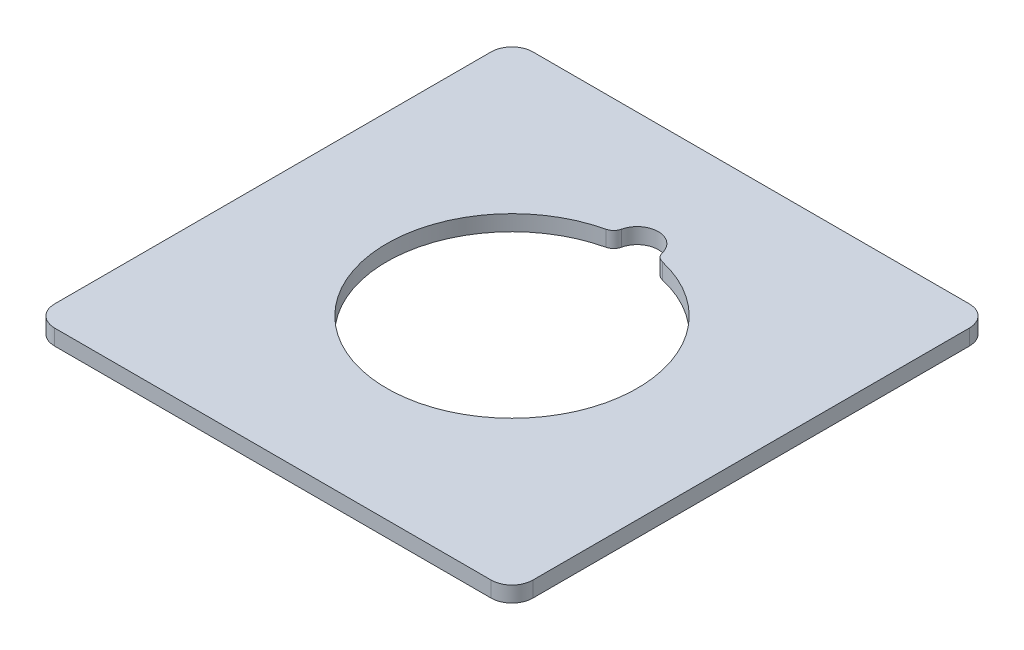
ISO-10303-21;
HEADER;
FILE_DESCRIPTION(('STEP AP214'),'2;1');
FILE_NAME('part.step','',(''),(''),'','','');
FILE_SCHEMA(('AUTOMOTIVE_DESIGN { 1 0 10303 214 1 1 1 1 }'));
ENDSEC;
DATA;
#1=APPLICATION_CONTEXT('core data for automotive mechanical design processes');
#2=APPLICATION_PROTOCOL_DEFINITION('international standard','automotive_design',2000,#1);
#3=PRODUCT_CONTEXT('',#1,'mechanical');
#4=PRODUCT('Part','Part','',(#3));
#5=PRODUCT_RELATED_PRODUCT_CATEGORY('part','',(#4));
#6=PRODUCT_DEFINITION_FORMATION('','',#4);
#7=PRODUCT_DEFINITION_CONTEXT('part definition',#1,'design');
#8=PRODUCT_DEFINITION('design','',#6,#7);
#9=PRODUCT_DEFINITION_SHAPE('','',#8);
#10=(LENGTH_UNIT() NAMED_UNIT(*) SI_UNIT(.MILLI.,.METRE.));
#11=(NAMED_UNIT(*) PLANE_ANGLE_UNIT() SI_UNIT($,.RADIAN.));
#12=(NAMED_UNIT(*) SI_UNIT($,.STERADIAN.) SOLID_ANGLE_UNIT());
#13=UNCERTAINTY_MEASURE_WITH_UNIT(LENGTH_MEASURE(1.E-05),#10,'distance_accuracy_value','');
#14=(GEOMETRIC_REPRESENTATION_CONTEXT(3) GLOBAL_UNCERTAINTY_ASSIGNED_CONTEXT((#13)) GLOBAL_UNIT_ASSIGNED_CONTEXT((#10,
#11,#12)) REPRESENTATION_CONTEXT('',''));
#15=CARTESIAN_POINT('',(0.,0.,0.));
#16=DIRECTION('',(0.,0.,1.));
#17=DIRECTION('',(1.,0.,0.));
#18=AXIS2_PLACEMENT_3D('',#15,#16,#17);
#19=CARTESIAN_POINT('',(20.9,1.5,20.9));
#20=DIRECTION('',(0.,1.,0.));
#21=DIRECTION('',(0.,0.,1.));
#22=AXIS2_PLACEMENT_3D('',#19,#20,#21);
#23=PLANE('',#22);
#24=CARTESIAN_POINT('',(20.9,1.5,20.9));
#25=DIRECTION('',(0.,1.,0.));
#26=DIRECTION('',(0.,0.,1.));
#27=AXIS2_PLACEMENT_3D('',#24,#25,#26);
#28=CIRCLE('',#27,2.);
#29=CARTESIAN_POINT('',(20.9,1.5,22.9));
#30=VERTEX_POINT('',#29);
#31=CARTESIAN_POINT('',(22.9,1.5,20.9));
#32=VERTEX_POINT('',#31);
#33=EDGE_CURVE('E157',#30,#32,#28,.T.);
#34=ORIENTED_EDGE('',*,*,#33,.T.);
#35=DIRECTION('',(0.,0.,-1.));
#36=VECTOR('',#35,1.);
#37=CARTESIAN_POINT('',(22.9,1.5,20.9));
#38=LINE('',#37,#36);
#39=CARTESIAN_POINT('',(22.9,1.5,-20.9));
#40=VERTEX_POINT('',#39);
#41=EDGE_CURVE('E160',#32,#40,#38,.T.);
#42=ORIENTED_EDGE('',*,*,#41,.T.);
#43=CARTESIAN_POINT('',(20.9,1.5,-20.9));
#44=DIRECTION('',(0.,1.,0.));
#45=DIRECTION('',(0.,0.,-1.));
#46=AXIS2_PLACEMENT_3D('',#43,#44,#45);
#47=CIRCLE('',#46,2.);
#48=CARTESIAN_POINT('',(20.9,1.5,-22.9));
#49=VERTEX_POINT('',#48);
#50=EDGE_CURVE('E163',#40,#49,#47,.T.);
#51=ORIENTED_EDGE('',*,*,#50,.T.);
#52=DIRECTION('',(-1.,0.,0.));
#53=VECTOR('',#52,1.);
#54=CARTESIAN_POINT('',(-20.9,1.5,-22.9));
#55=LINE('',#54,#53);
#56=CARTESIAN_POINT('',(-20.9,1.5,-22.9));
#57=VERTEX_POINT('',#56);
#58=EDGE_CURVE('E165',#49,#57,#55,.T.);
#59=ORIENTED_EDGE('',*,*,#58,.T.);
#60=CARTESIAN_POINT('',(-20.9,1.5,-20.9));
#61=DIRECTION('',(0.,1.,0.));
#62=DIRECTION('',(0.,0.,-1.));
#63=AXIS2_PLACEMENT_3D('',#60,#61,#62);
#64=CIRCLE('',#63,2.);
#65=CARTESIAN_POINT('',(-22.9,1.5,-20.9));
#66=VERTEX_POINT('',#65);
#67=EDGE_CURVE('E167',#57,#66,#64,.T.);
#68=ORIENTED_EDGE('',*,*,#67,.T.);
#69=DIRECTION('',(0.,0.,1.));
#70=VECTOR('',#69,1.);
#71=CARTESIAN_POINT('',(-22.9,1.5,20.9));
#72=LINE('',#71,#70);
#73=CARTESIAN_POINT('',(-22.9,1.5,20.9));
#74=VERTEX_POINT('',#73);
#75=EDGE_CURVE('E169',#66,#74,#72,.T.);
#76=ORIENTED_EDGE('',*,*,#75,.T.);
#77=CARTESIAN_POINT('',(-20.9,1.5,20.9));
#78=DIRECTION('',(0.,1.,0.));
#79=DIRECTION('',(0.,0.,-1.));
#80=AXIS2_PLACEMENT_3D('',#77,#78,#79);
#81=CIRCLE('',#80,2.);
#82=CARTESIAN_POINT('',(-20.9,1.5,22.9));
#83=VERTEX_POINT('',#82);
#84=EDGE_CURVE('E171',#74,#83,#81,.T.);
#85=ORIENTED_EDGE('',*,*,#84,.T.);
#86=DIRECTION('',(1.,0.,0.));
#87=VECTOR('',#86,1.);
#88=CARTESIAN_POINT('',(-20.9,1.5,22.9));
#89=LINE('',#88,#87);
#90=EDGE_CURVE('E173',#83,#30,#89,.T.);
#91=ORIENTED_EDGE('',*,*,#90,.T.);
#92=EDGE_LOOP('',(#34,#42,#51,#59,#68,#76,#85,#91));
#93=FACE_BOUND('',#92,.T.);
#94=CARTESIAN_POINT('',(0.,1.5,-11.9935026557354));
#95=DIRECTION('',(0.,1.,0.));
#96=DIRECTION('',(0.,0.,-1.));
#97=AXIS2_PLACEMENT_3D('',#94,#95,#96);
#98=CIRCLE('',#97,2.00649734426464);
#99=CARTESIAN_POINT('',(1.95574883411882,1.5,-12.4419199729566));
#100=VERTEX_POINT('',#99);
#101=CARTESIAN_POINT('',(-1.95574883411884,1.5,-12.4419199729566));
#102=VERTEX_POINT('',#101);
#103=EDGE_CURVE('E129',#100,#102,#98,.T.);
#104=ORIENTED_EDGE('',*,*,#103,.F.);
#105=CARTESIAN_POINT('',(2.93045674475181,1.5,-12.665402609753));
#106=DIRECTION('',(0.,-1.,0.));
#107=DIRECTION('',(0.,0.,1.));
#108=AXIS2_PLACEMENT_3D('',#105,#106,#107);
#109=CIRCLE('',#108,1.);
#110=CARTESIAN_POINT('',(2.70503699515552,1.5,-11.6911408705412));
#111=VERTEX_POINT('',#110);
#112=EDGE_CURVE('E121',#111,#100,#109,.T.);
#113=ORIENTED_EDGE('',*,*,#112,.F.);
#114=CARTESIAN_POINT('',(0.,1.5,0.));
#115=DIRECTION('',(0.,1.,0.));
#116=DIRECTION('',(0.,0.,1.));
#117=AXIS2_PLACEMENT_3D('',#114,#115,#116);
#118=CIRCLE('',#117,12.);
#119=CARTESIAN_POINT('',(-2.70503699515553,1.5,-11.6911408705412));
#120=VERTEX_POINT('',#119);
#121=EDGE_CURVE('E143',#120,#111,#118,.T.);
#122=ORIENTED_EDGE('',*,*,#121,.F.);
#123=CARTESIAN_POINT('',(-2.93045674475182,1.5,-12.665402609753));
#124=DIRECTION('',(0.,-1.,0.));
#125=DIRECTION('',(0.,0.,-1.));
#126=AXIS2_PLACEMENT_3D('',#123,#124,#125);
#127=CIRCLE('',#126,1.);
#128=EDGE_CURVE('E141',#102,#120,#127,.T.);
#129=ORIENTED_EDGE('',*,*,#128,.F.);
#130=EDGE_LOOP('',(#104,#113,#122,#129));
#131=FACE_BOUND('',#130,.T.);
#132=ADVANCED_FACE('F32',(#93,#131),#23,.T.);
#133=CARTESIAN_POINT('',(20.9,0.,20.9));
#134=DIRECTION('',(0.,1.,0.));
#135=DIRECTION('',(0.,0.,1.));
#136=AXIS2_PLACEMENT_3D('',#133,#134,#135);
#137=PLANE('',#136);
#138=CARTESIAN_POINT('',(20.9,0.,20.9));
#139=DIRECTION('',(0.,1.,0.));
#140=DIRECTION('',(0.,0.,1.));
#141=AXIS2_PLACEMENT_3D('',#138,#139,#140);
#142=CIRCLE('',#141,2.);
#143=CARTESIAN_POINT('',(20.9,0.,22.9));
#144=VERTEX_POINT('',#143);
#145=CARTESIAN_POINT('',(22.9,0.,20.9));
#146=VERTEX_POINT('',#145);
#147=EDGE_CURVE('E137',#144,#146,#142,.T.);
#148=ORIENTED_EDGE('',*,*,#147,.F.);
#149=DIRECTION('',(1.,0.,0.));
#150=VECTOR('',#149,1.);
#151=CARTESIAN_POINT('',(-20.9,0.,22.9));
#152=LINE('',#151,#150);
#153=CARTESIAN_POINT('',(-20.9,0.,22.9));
#154=VERTEX_POINT('',#153);
#155=EDGE_CURVE('E161',#154,#144,#152,.T.);
#156=ORIENTED_EDGE('',*,*,#155,.F.);
#157=CARTESIAN_POINT('',(-20.9,0.,20.9));
#158=DIRECTION('',(0.,1.,0.));
#159=DIRECTION('',(0.,0.,-1.));
#160=AXIS2_PLACEMENT_3D('',#157,#158,#159);
#161=CIRCLE('',#160,2.);
#162=CARTESIAN_POINT('',(-22.9,0.,20.9));
#163=VERTEX_POINT('',#162);
#164=EDGE_CURVE('E188',#163,#154,#161,.T.);
#165=ORIENTED_EDGE('',*,*,#164,.F.);
#166=DIRECTION('',(0.,0.,1.));
#167=VECTOR('',#166,1.);
#168=CARTESIAN_POINT('',(-22.9,0.,20.9));
#169=LINE('',#168,#167);
#170=CARTESIAN_POINT('',(-22.9,0.,-20.9));
#171=VERTEX_POINT('',#170);
#172=EDGE_CURVE('E186',#171,#163,#169,.T.);
#173=ORIENTED_EDGE('',*,*,#172,.F.);
#174=CARTESIAN_POINT('',(-20.9,0.,-20.9));
#175=DIRECTION('',(0.,1.,0.));
#176=DIRECTION('',(0.,0.,-1.));
#177=AXIS2_PLACEMENT_3D('',#174,#175,#176);
#178=CIRCLE('',#177,2.);
#179=CARTESIAN_POINT('',(-20.9,0.,-22.9));
#180=VERTEX_POINT('',#179);
#181=EDGE_CURVE('E184',#180,#171,#178,.T.);
#182=ORIENTED_EDGE('',*,*,#181,.F.);
#183=DIRECTION('',(-1.,0.,0.));
#184=VECTOR('',#183,1.);
#185=CARTESIAN_POINT('',(-20.9,0.,-22.9));
#186=LINE('',#185,#184);
#187=CARTESIAN_POINT('',(20.9,0.,-22.9));
#188=VERTEX_POINT('',#187);
#189=EDGE_CURVE('E182',#188,#180,#186,.T.);
#190=ORIENTED_EDGE('',*,*,#189,.F.);
#191=CARTESIAN_POINT('',(20.9,0.,-20.9));
#192=DIRECTION('',(0.,1.,0.));
#193=DIRECTION('',(0.,0.,-1.));
#194=AXIS2_PLACEMENT_3D('',#191,#192,#193);
#195=CIRCLE('',#194,2.);
#196=CARTESIAN_POINT('',(22.9,0.,-20.9));
#197=VERTEX_POINT('',#196);
#198=EDGE_CURVE('E180',#197,#188,#195,.T.);
#199=ORIENTED_EDGE('',*,*,#198,.F.);
#200=DIRECTION('',(0.,0.,-1.));
#201=VECTOR('',#200,1.);
#202=CARTESIAN_POINT('',(22.9,0.,20.9));
#203=LINE('',#202,#201);
#204=EDGE_CURVE('E178',#146,#197,#203,.T.);
#205=ORIENTED_EDGE('',*,*,#204,.F.);
#206=EDGE_LOOP('',(#148,#156,#165,#173,#182,#190,#199,#205));
#207=FACE_BOUND('',#206,.T.);
#208=CARTESIAN_POINT('',(2.93045674475181,0.,-12.665402609753));
#209=DIRECTION('',(0.,-1.,0.));
#210=DIRECTION('',(0.,0.,1.));
#211=AXIS2_PLACEMENT_3D('',#208,#209,#210);
#212=CIRCLE('',#211,1.);
#213=CARTESIAN_POINT('',(2.70503699515552,0.,-11.6911408705412));
#214=VERTEX_POINT('',#213);
#215=CARTESIAN_POINT('',(1.95574883411882,0.,-12.4419199729566));
#216=VERTEX_POINT('',#215);
#217=EDGE_CURVE('E55',#214,#216,#212,.T.);
#218=ORIENTED_EDGE('',*,*,#217,.T.);
#219=CARTESIAN_POINT('',(0.,0.,-11.9935026557354));
#220=DIRECTION('',(0.,1.,0.));
#221=DIRECTION('',(0.,0.,-1.));
#222=AXIS2_PLACEMENT_3D('',#219,#220,#221);
#223=CIRCLE('',#222,2.00649734426464);
#224=CARTESIAN_POINT('',(-1.95574883411884,0.,-12.4419199729566));
#225=VERTEX_POINT('',#224);
#226=EDGE_CURVE('E136',#216,#225,#223,.T.);
#227=ORIENTED_EDGE('',*,*,#226,.T.);
#228=CARTESIAN_POINT('',(-2.93045674475182,0.,-12.665402609753));
#229=DIRECTION('',(0.,-1.,0.));
#230=DIRECTION('',(0.,0.,-1.));
#231=AXIS2_PLACEMENT_3D('',#228,#229,#230);
#232=CIRCLE('',#231,1.);
#233=CARTESIAN_POINT('',(-2.70503699515553,0.,-11.6911408705412));
#234=VERTEX_POINT('',#233);
#235=EDGE_CURVE('E149',#225,#234,#232,.T.);
#236=ORIENTED_EDGE('',*,*,#235,.T.);
#237=CARTESIAN_POINT('',(0.,0.,0.));
#238=DIRECTION('',(0.,1.,0.));
#239=DIRECTION('',(0.,0.,1.));
#240=AXIS2_PLACEMENT_3D('',#237,#238,#239);
#241=CIRCLE('',#240,12.);
#242=EDGE_CURVE('E130',#234,#214,#241,.T.);
#243=ORIENTED_EDGE('',*,*,#242,.T.);
#244=EDGE_LOOP('',(#218,#227,#236,#243));
#245=FACE_BOUND('',#244,.T.);
#246=ADVANCED_FACE('F218',(#207,#245),#137,.F.);
#247=CARTESIAN_POINT('',(20.9,1.5,20.9));
#248=DIRECTION('',(0.,-1.,0.));
#249=DIRECTION('',(0.,0.,-1.));
#250=AXIS2_PLACEMENT_3D('',#247,#248,#249);
#251=CYLINDRICAL_SURFACE('',#250,2.);
#252=ORIENTED_EDGE('',*,*,#147,.T.);
#253=DIRECTION('',(0.,-1.,0.));
#254=VECTOR('',#253,1.);
#255=CARTESIAN_POINT('',(22.9,1.5,20.9));
#256=LINE('',#255,#254);
#257=EDGE_CURVE('E11',#32,#146,#256,.T.);
#258=ORIENTED_EDGE('',*,*,#257,.F.);
#259=ORIENTED_EDGE('',*,*,#33,.F.);
#260=DIRECTION('',(0.,-1.,0.));
#261=VECTOR('',#260,1.);
#262=CARTESIAN_POINT('',(20.9,1.5,22.9));
#263=LINE('',#262,#261);
#264=EDGE_CURVE('E175',#30,#144,#263,.T.);
#265=ORIENTED_EDGE('',*,*,#264,.T.);
#266=EDGE_LOOP('',(#252,#258,#259,#265));
#267=FACE_BOUND('',#266,.T.);
#268=ADVANCED_FACE('F34',(#267),#251,.T.);
#269=CARTESIAN_POINT('',(22.9,1.5,20.9));
#270=DIRECTION('',(-1.,0.,0.));
#271=DIRECTION('',(0.,0.,1.));
#272=AXIS2_PLACEMENT_3D('',#269,#270,#271);
#273=PLANE('',#272);
#274=ORIENTED_EDGE('',*,*,#204,.T.);
#275=DIRECTION('',(0.,-1.,0.));
#276=VECTOR('',#275,1.);
#277=CARTESIAN_POINT('',(22.9,1.5,-20.9));
#278=LINE('',#277,#276);
#279=EDGE_CURVE('E40',#40,#197,#278,.T.);
#280=ORIENTED_EDGE('',*,*,#279,.F.);
#281=ORIENTED_EDGE('',*,*,#41,.F.);
#282=ORIENTED_EDGE('',*,*,#257,.T.);
#283=EDGE_LOOP('',(#274,#280,#281,#282));
#284=FACE_BOUND('',#283,.T.);
#285=ADVANCED_FACE('F235',(#284),#273,.F.);
#286=CARTESIAN_POINT('',(20.9,1.5,-20.9));
#287=DIRECTION('',(0.,-1.,0.));
#288=DIRECTION('',(0.,0.,-1.));
#289=AXIS2_PLACEMENT_3D('',#286,#287,#288);
#290=CYLINDRICAL_SURFACE('',#289,2.);
#291=ORIENTED_EDGE('',*,*,#198,.T.);
#292=DIRECTION('',(0.,-1.,0.));
#293=VECTOR('',#292,1.);
#294=CARTESIAN_POINT('',(20.9,1.5,-22.9));
#295=LINE('',#294,#293);
#296=EDGE_CURVE('E205',#49,#188,#295,.T.);
#297=ORIENTED_EDGE('',*,*,#296,.F.);
#298=ORIENTED_EDGE('',*,*,#50,.F.);
#299=ORIENTED_EDGE('',*,*,#279,.T.);
#300=EDGE_LOOP('',(#291,#297,#298,#299));
#301=FACE_BOUND('',#300,.T.);
#302=ADVANCED_FACE('F212',(#301),#290,.T.);
#303=CARTESIAN_POINT('',(-20.9,1.5,-22.9));
#304=DIRECTION('',(0.,0.,1.));
#305=DIRECTION('',(1.,0.,0.));
#306=AXIS2_PLACEMENT_3D('',#303,#304,#305);
#307=PLANE('',#306);
#308=ORIENTED_EDGE('',*,*,#189,.T.);
#309=DIRECTION('',(0.,-1.,0.));
#310=VECTOR('',#309,1.);
#311=CARTESIAN_POINT('',(-20.9,1.5,-22.9));
#312=LINE('',#311,#310);
#313=EDGE_CURVE('E202',#57,#180,#312,.T.);
#314=ORIENTED_EDGE('',*,*,#313,.F.);
#315=ORIENTED_EDGE('',*,*,#58,.F.);
#316=ORIENTED_EDGE('',*,*,#296,.T.);
#317=EDGE_LOOP('',(#308,#314,#315,#316));
#318=FACE_BOUND('',#317,.T.);
#319=ADVANCED_FACE('F224',(#318),#307,.F.);
#320=CARTESIAN_POINT('',(-20.9,1.5,-20.9));
#321=DIRECTION('',(0.,-1.,0.));
#322=DIRECTION('',(0.,0.,-1.));
#323=AXIS2_PLACEMENT_3D('',#320,#321,#322);
#324=CYLINDRICAL_SURFACE('',#323,2.);
#325=ORIENTED_EDGE('',*,*,#181,.T.);
#326=DIRECTION('',(0.,-1.,0.));
#327=VECTOR('',#326,1.);
#328=CARTESIAN_POINT('',(-22.9,1.5,-20.9));
#329=LINE('',#328,#327);
#330=EDGE_CURVE('E199',#66,#171,#329,.T.);
#331=ORIENTED_EDGE('',*,*,#330,.F.);
#332=ORIENTED_EDGE('',*,*,#67,.F.);
#333=ORIENTED_EDGE('',*,*,#313,.T.);
#334=EDGE_LOOP('',(#325,#331,#332,#333));
#335=FACE_BOUND('',#334,.T.);
#336=ADVANCED_FACE('F228',(#335),#324,.T.);
#337=CARTESIAN_POINT('',(-22.9,1.5,20.9));
#338=DIRECTION('',(1.,0.,0.));
#339=DIRECTION('',(0.,0.,-1.));
#340=AXIS2_PLACEMENT_3D('',#337,#338,#339);
#341=PLANE('',#340);
#342=ORIENTED_EDGE('',*,*,#172,.T.);
#343=DIRECTION('',(0.,-1.,0.));
#344=VECTOR('',#343,1.);
#345=CARTESIAN_POINT('',(-22.9,1.5,20.9));
#346=LINE('',#345,#344);
#347=EDGE_CURVE('E196',#74,#163,#346,.T.);
#348=ORIENTED_EDGE('',*,*,#347,.F.);
#349=ORIENTED_EDGE('',*,*,#75,.F.);
#350=ORIENTED_EDGE('',*,*,#330,.T.);
#351=EDGE_LOOP('',(#342,#348,#349,#350));
#352=FACE_BOUND('',#351,.T.);
#353=ADVANCED_FACE('F248',(#352),#341,.F.);
#354=CARTESIAN_POINT('',(-20.9,1.5,20.9));
#355=DIRECTION('',(0.,-1.,0.));
#356=DIRECTION('',(0.,0.,-1.));
#357=AXIS2_PLACEMENT_3D('',#354,#355,#356);
#358=CYLINDRICAL_SURFACE('',#357,2.);
#359=ORIENTED_EDGE('',*,*,#164,.T.);
#360=DIRECTION('',(0.,-1.,0.));
#361=VECTOR('',#360,1.);
#362=CARTESIAN_POINT('',(-20.9,1.5,22.9));
#363=LINE('',#362,#361);
#364=EDGE_CURVE('E193',#83,#154,#363,.T.);
#365=ORIENTED_EDGE('',*,*,#364,.F.);
#366=ORIENTED_EDGE('',*,*,#84,.F.);
#367=ORIENTED_EDGE('',*,*,#347,.T.);
#368=EDGE_LOOP('',(#359,#365,#366,#367));
#369=FACE_BOUND('',#368,.T.);
#370=ADVANCED_FACE('F246',(#369),#358,.T.);
#371=CARTESIAN_POINT('',(-20.9,1.5,22.9));
#372=DIRECTION('',(0.,0.,-1.));
#373=DIRECTION('',(-1.,0.,0.));
#374=AXIS2_PLACEMENT_3D('',#371,#372,#373);
#375=PLANE('',#374);
#376=ORIENTED_EDGE('',*,*,#155,.T.);
#377=ORIENTED_EDGE('',*,*,#264,.F.);
#378=ORIENTED_EDGE('',*,*,#90,.F.);
#379=ORIENTED_EDGE('',*,*,#364,.T.);
#380=EDGE_LOOP('',(#376,#377,#378,#379));
#381=FACE_BOUND('',#380,.T.);
#382=ADVANCED_FACE('F241',(#381),#375,.F.);
#383=CARTESIAN_POINT('',(2.93045674475181,1.5,-12.665402609753));
#384=DIRECTION('',(0.,-1.,0.));
#385=DIRECTION('',(0.,0.,-1.));
#386=AXIS2_PLACEMENT_3D('',#383,#384,#385);
#387=CYLINDRICAL_SURFACE('',#386,1.);
#388=ORIENTED_EDGE('',*,*,#217,.F.);
#389=DIRECTION('',(0.,-1.,0.));
#390=VECTOR('',#389,1.);
#391=CARTESIAN_POINT('',(2.70503699515552,1.5,-11.6911408705412));
#392=LINE('',#391,#390);
#393=EDGE_CURVE('E125',#111,#214,#392,.T.);
#394=ORIENTED_EDGE('',*,*,#393,.F.);
#395=ORIENTED_EDGE('',*,*,#112,.T.);
#396=DIRECTION('',(0.,-1.,0.));
#397=VECTOR('',#396,1.);
#398=CARTESIAN_POINT('',(1.95574883411882,1.5,-12.4419199729566));
#399=LINE('',#398,#397);
#400=EDGE_CURVE('E124',#100,#216,#399,.T.);
#401=ORIENTED_EDGE('',*,*,#400,.T.);
#402=EDGE_LOOP('',(#388,#394,#395,#401));
#403=FACE_BOUND('',#402,.T.);
#404=ADVANCED_FACE('F123',(#403),#387,.T.);
#405=CARTESIAN_POINT('',(0.,1.5,-11.9935026557354));
#406=DIRECTION('',(0.,-1.,0.));
#407=DIRECTION('',(0.,0.,-1.));
#408=AXIS2_PLACEMENT_3D('',#405,#406,#407);
#409=CYLINDRICAL_SURFACE('',#408,2.00649734426464);
#410=ORIENTED_EDGE('',*,*,#226,.F.);
#411=ORIENTED_EDGE('',*,*,#400,.F.);
#412=ORIENTED_EDGE('',*,*,#103,.T.);
#413=DIRECTION('',(0.,-1.,0.));
#414=VECTOR('',#413,1.);
#415=CARTESIAN_POINT('',(-1.95574883411884,1.5,-12.4419199729566));
#416=LINE('',#415,#414);
#417=EDGE_CURVE('E138',#102,#225,#416,.T.);
#418=ORIENTED_EDGE('',*,*,#417,.T.);
#419=EDGE_LOOP('',(#410,#411,#412,#418));
#420=FACE_BOUND('',#419,.T.);
#421=ADVANCED_FACE('F133',(#420),#409,.F.);
#422=CARTESIAN_POINT('',(-2.93045674475182,1.5,-12.665402609753));
#423=DIRECTION('',(0.,-1.,0.));
#424=DIRECTION('',(0.,0.,-1.));
#425=AXIS2_PLACEMENT_3D('',#422,#423,#424);
#426=CYLINDRICAL_SURFACE('',#425,1.);
#427=ORIENTED_EDGE('',*,*,#235,.F.);
#428=ORIENTED_EDGE('',*,*,#417,.F.);
#429=ORIENTED_EDGE('',*,*,#128,.T.);
#430=DIRECTION('',(0.,-1.,0.));
#431=VECTOR('',#430,1.);
#432=CARTESIAN_POINT('',(-2.70503699515553,1.5,-11.6911408705412));
#433=LINE('',#432,#431);
#434=EDGE_CURVE('E47',#120,#234,#433,.T.);
#435=ORIENTED_EDGE('',*,*,#434,.T.);
#436=EDGE_LOOP('',(#427,#428,#429,#435));
#437=FACE_BOUND('',#436,.T.);
#438=ADVANCED_FACE('F273',(#437),#426,.T.);
#439=CARTESIAN_POINT('',(0.,1.5,0.));
#440=DIRECTION('',(0.,-1.,0.));
#441=DIRECTION('',(0.,0.,-1.));
#442=AXIS2_PLACEMENT_3D('',#439,#440,#441);
#443=CYLINDRICAL_SURFACE('',#442,12.);
#444=ORIENTED_EDGE('',*,*,#242,.F.);
#445=ORIENTED_EDGE('',*,*,#434,.F.);
#446=ORIENTED_EDGE('',*,*,#121,.T.);
#447=ORIENTED_EDGE('',*,*,#393,.T.);
#448=EDGE_LOOP('',(#444,#445,#446,#447));
#449=FACE_BOUND('',#448,.T.);
#450=ADVANCED_FACE('F277',(#449),#443,.F.);
#451=CLOSED_SHELL('',(#132,#246,#268,#285,#302,#319,#336,#353,#370,#382,#404,#421,#438,#450));
#452=MANIFOLD_SOLID_BREP('B2',#451);
#453=ADVANCED_BREP_SHAPE_REPRESENTATION('',(#18,#452),#14);
#454=SHAPE_DEFINITION_REPRESENTATION(#9,#453);
ENDSEC;
END-ISO-10303-21;
